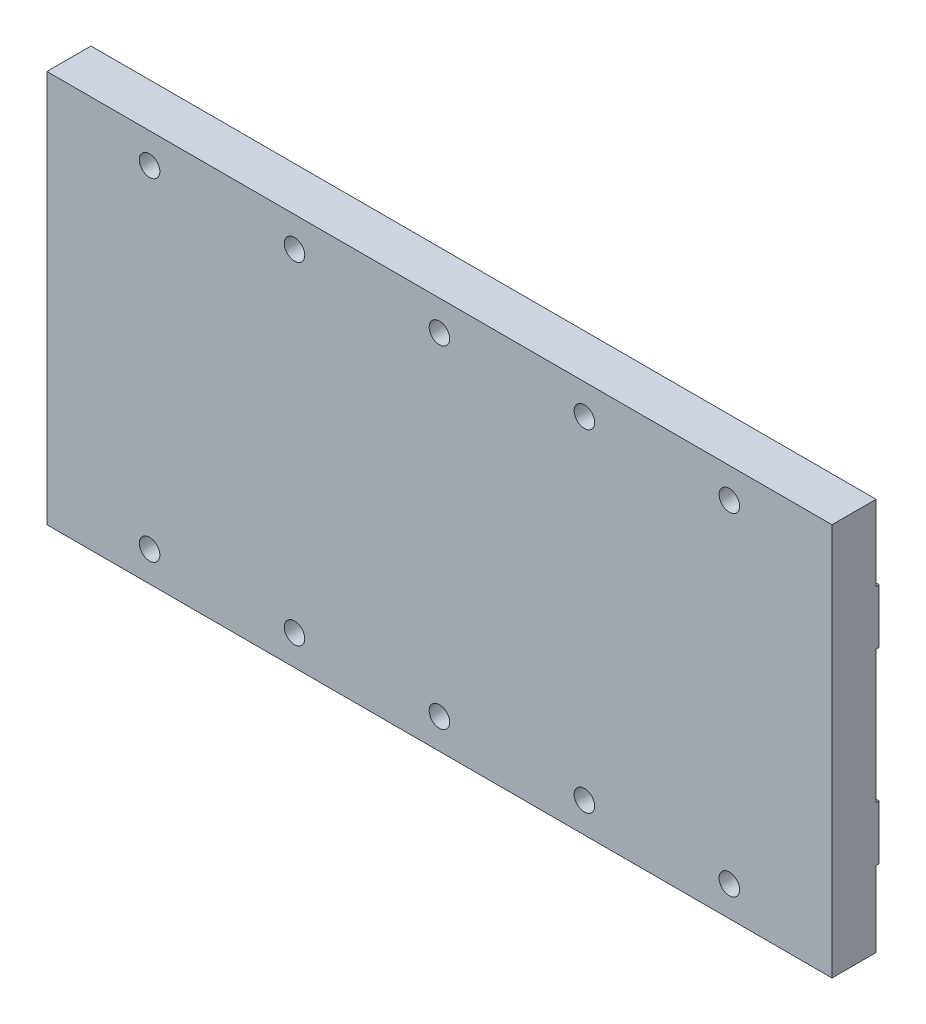
ISO-10303-21;
HEADER;
FILE_DESCRIPTION(('STEP AP214'),'2;1');
FILE_NAME('part.step','',(''),(''),'','','');
FILE_SCHEMA(('AUTOMOTIVE_DESIGN { 1 0 10303 214 1 1 1 1 }'));
ENDSEC;
DATA;
#1=APPLICATION_CONTEXT('core data for automotive mechanical design processes');
#2=APPLICATION_PROTOCOL_DEFINITION('international standard','automotive_design',2000,#1);
#3=PRODUCT_CONTEXT('',#1,'mechanical');
#4=PRODUCT('Part','Part','',(#3));
#5=PRODUCT_RELATED_PRODUCT_CATEGORY('part','',(#4));
#6=PRODUCT_DEFINITION_FORMATION('','',#4);
#7=PRODUCT_DEFINITION_CONTEXT('part definition',#1,'design');
#8=PRODUCT_DEFINITION('design','',#6,#7);
#9=PRODUCT_DEFINITION_SHAPE('','',#8);
#10=(LENGTH_UNIT() NAMED_UNIT(*) SI_UNIT(.MILLI.,.METRE.));
#11=(NAMED_UNIT(*) PLANE_ANGLE_UNIT() SI_UNIT($,.RADIAN.));
#12=(NAMED_UNIT(*) SI_UNIT($,.STERADIAN.) SOLID_ANGLE_UNIT());
#13=UNCERTAINTY_MEASURE_WITH_UNIT(LENGTH_MEASURE(1.E-05),#10,'distance_accuracy_value','');
#14=(GEOMETRIC_REPRESENTATION_CONTEXT(3) GLOBAL_UNCERTAINTY_ASSIGNED_CONTEXT((#13)) GLOBAL_UNIT_ASSIGNED_CONTEXT((#10,
#11,#12)) REPRESENTATION_CONTEXT('',''));
#15=CARTESIAN_POINT('',(0.,0.,0.));
#16=DIRECTION('',(0.,0.,1.));
#17=DIRECTION('',(1.,0.,0.));
#18=AXIS2_PLACEMENT_3D('',#15,#16,#17);
#19=CARTESIAN_POINT('',(0.,0.,7.8));
#20=DIRECTION('',(0.,0.,-1.));
#21=DIRECTION('',(-1.,0.,0.));
#22=AXIS2_PLACEMENT_3D('',#19,#20,#21);
#23=PLANE('',#22);
#24=CARTESIAN_POINT('',(17.,60.,7.8));
#25=DIRECTION('',(0.,0.,1.));
#26=DIRECTION('',(1.,0.,0.));
#27=AXIS2_PLACEMENT_3D('',#24,#25,#26);
#28=CIRCLE('',#27,1.69999999999999);
#29=CARTESIAN_POINT('',(18.7,60.,7.8));
#30=VERTEX_POINT('',#29);
#31=EDGE_CURVE('E835',#30,#30,#28,.T.);
#32=ORIENTED_EDGE('',*,*,#31,.F.);
#33=EDGE_LOOP('',(#32));
#34=FACE_BOUND('',#33,.T.);
#35=CARTESIAN_POINT('',(41.,60.,7.8));
#36=DIRECTION('',(0.,0.,1.));
#37=DIRECTION('',(1.,0.,0.));
#38=AXIS2_PLACEMENT_3D('',#35,#36,#37);
#39=CIRCLE('',#38,1.69999999999999);
#40=CARTESIAN_POINT('',(42.7,60.,7.8));
#41=VERTEX_POINT('',#40);
#42=EDGE_CURVE('E349',#41,#41,#39,.T.);
#43=ORIENTED_EDGE('',*,*,#42,.F.);
#44=EDGE_LOOP('',(#43));
#45=FACE_BOUND('',#44,.T.);
#46=CARTESIAN_POINT('',(65.,60.,7.8));
#47=DIRECTION('',(0.,0.,1.));
#48=DIRECTION('',(1.,0.,0.));
#49=AXIS2_PLACEMENT_3D('',#46,#47,#48);
#50=CIRCLE('',#49,1.69999999999999);
#51=CARTESIAN_POINT('',(66.7,60.,7.8));
#52=VERTEX_POINT('',#51);
#53=EDGE_CURVE('E340',#52,#52,#50,.T.);
#54=ORIENTED_EDGE('',*,*,#53,.F.);
#55=EDGE_LOOP('',(#54));
#56=FACE_BOUND('',#55,.T.);
#57=CARTESIAN_POINT('',(89.,60.,7.8));
#58=DIRECTION('',(0.,0.,1.));
#59=DIRECTION('',(1.,0.,0.));
#60=AXIS2_PLACEMENT_3D('',#57,#58,#59);
#61=CIRCLE('',#60,1.69999999999999);
#62=CARTESIAN_POINT('',(90.7,60.,7.8));
#63=VERTEX_POINT('',#62);
#64=EDGE_CURVE('E335',#63,#63,#61,.T.);
#65=ORIENTED_EDGE('',*,*,#64,.F.);
#66=EDGE_LOOP('',(#65));
#67=FACE_BOUND('',#66,.T.);
#68=CARTESIAN_POINT('',(113.,60.,7.8));
#69=DIRECTION('',(0.,0.,1.));
#70=DIRECTION('',(1.,0.,0.));
#71=AXIS2_PLACEMENT_3D('',#68,#69,#70);
#72=CIRCLE('',#71,1.69999999999999);
#73=CARTESIAN_POINT('',(114.7,60.,7.8));
#74=VERTEX_POINT('',#73);
#75=EDGE_CURVE('E330',#74,#74,#72,.T.);
#76=ORIENTED_EDGE('',*,*,#75,.F.);
#77=EDGE_LOOP('',(#76));
#78=FACE_BOUND('',#77,.T.);
#79=CARTESIAN_POINT('',(113.,5.,7.8));
#80=DIRECTION('',(0.,0.,1.));
#81=DIRECTION('',(1.,0.,0.));
#82=AXIS2_PLACEMENT_3D('',#79,#80,#81);
#83=CIRCLE('',#82,1.69999999999999);
#84=CARTESIAN_POINT('',(114.7,5.,7.8));
#85=VERTEX_POINT('',#84);
#86=EDGE_CURVE('E324',#85,#85,#83,.T.);
#87=ORIENTED_EDGE('',*,*,#86,.F.);
#88=EDGE_LOOP('',(#87));
#89=FACE_BOUND('',#88,.T.);
#90=CARTESIAN_POINT('',(89.,5.,7.8));
#91=DIRECTION('',(0.,0.,1.));
#92=DIRECTION('',(1.,0.,0.));
#93=AXIS2_PLACEMENT_3D('',#90,#91,#92);
#94=CIRCLE('',#93,1.69999999999999);
#95=CARTESIAN_POINT('',(90.7,5.,7.8));
#96=VERTEX_POINT('',#95);
#97=EDGE_CURVE('E318',#96,#96,#94,.T.);
#98=ORIENTED_EDGE('',*,*,#97,.F.);
#99=EDGE_LOOP('',(#98));
#100=FACE_BOUND('',#99,.T.);
#101=CARTESIAN_POINT('',(65.,5.,7.8));
#102=DIRECTION('',(0.,0.,1.));
#103=DIRECTION('',(1.,0.,0.));
#104=AXIS2_PLACEMENT_3D('',#101,#102,#103);
#105=CIRCLE('',#104,1.69999999999999);
#106=CARTESIAN_POINT('',(66.7,5.,7.8));
#107=VERTEX_POINT('',#106);
#108=EDGE_CURVE('E312',#107,#107,#105,.T.);
#109=ORIENTED_EDGE('',*,*,#108,.F.);
#110=EDGE_LOOP('',(#109));
#111=FACE_BOUND('',#110,.T.);
#112=CARTESIAN_POINT('',(41.,5.,7.8));
#113=DIRECTION('',(0.,0.,1.));
#114=DIRECTION('',(1.,0.,0.));
#115=AXIS2_PLACEMENT_3D('',#112,#113,#114);
#116=CIRCLE('',#115,1.69999999999999);
#117=CARTESIAN_POINT('',(42.7,5.,7.8));
#118=VERTEX_POINT('',#117);
#119=EDGE_CURVE('E306',#118,#118,#116,.T.);
#120=ORIENTED_EDGE('',*,*,#119,.F.);
#121=EDGE_LOOP('',(#120));
#122=FACE_BOUND('',#121,.T.);
#123=DIRECTION('',(0.,-1.,0.));
#124=VECTOR('',#123,1.);
#125=CARTESIAN_POINT('',(0.,0.,7.8));
#126=LINE('',#125,#124);
#127=CARTESIAN_POINT('',(0.,65.,7.8));
#128=VERTEX_POINT('',#127);
#129=CARTESIAN_POINT('',(0.,0.,7.8));
#130=VERTEX_POINT('',#129);
#131=EDGE_CURVE('E256',#128,#130,#126,.T.);
#132=ORIENTED_EDGE('',*,*,#131,.T.);
#133=DIRECTION('',(1.,0.,0.));
#134=VECTOR('',#133,1.);
#135=CARTESIAN_POINT('',(0.,0.,7.8));
#136=LINE('',#135,#134);
#137=CARTESIAN_POINT('',(130.,0.,7.8));
#138=VERTEX_POINT('',#137);
#139=EDGE_CURVE('E260',#130,#138,#136,.T.);
#140=ORIENTED_EDGE('',*,*,#139,.T.);
#141=DIRECTION('',(0.,1.,0.));
#142=VECTOR('',#141,1.);
#143=CARTESIAN_POINT('',(130.,0.,7.8));
#144=LINE('',#143,#142);
#145=CARTESIAN_POINT('',(130.,65.,7.8));
#146=VERTEX_POINT('',#145);
#147=EDGE_CURVE('E264',#138,#146,#144,.T.);
#148=ORIENTED_EDGE('',*,*,#147,.T.);
#149=DIRECTION('',(-1.,0.,0.));
#150=VECTOR('',#149,1.);
#151=CARTESIAN_POINT('',(0.,65.,7.8));
#152=LINE('',#151,#150);
#153=EDGE_CURVE('E267',#146,#128,#152,.T.);
#154=ORIENTED_EDGE('',*,*,#153,.T.);
#155=EDGE_LOOP('',(#132,#140,#148,#154));
#156=FACE_BOUND('',#155,.T.);
#157=CARTESIAN_POINT('',(17.,5.,7.8));
#158=DIRECTION('',(0.,0.,1.));
#159=DIRECTION('',(1.,0.,0.));
#160=AXIS2_PLACEMENT_3D('',#157,#158,#159);
#161=CIRCLE('',#160,1.69999999999999);
#162=CARTESIAN_POINT('',(18.7,5.,7.8));
#163=VERTEX_POINT('',#162);
#164=EDGE_CURVE('E300',#163,#163,#161,.T.);
#165=ORIENTED_EDGE('',*,*,#164,.F.);
#166=EDGE_LOOP('',(#165));
#167=FACE_BOUND('',#166,.T.);
#168=ADVANCED_FACE('F39',(#34,#45,#56,#67,#78,#89,#100,#111,#122,#156,#167),#23,.F.);
#169=CARTESIAN_POINT('',(0.,0.,0.));
#170=DIRECTION('',(0.,0.,-1.));
#171=DIRECTION('',(-1.,0.,0.));
#172=AXIS2_PLACEMENT_3D('',#169,#170,#171);
#173=PLANE('',#172);
#174=DIRECTION('',(-1.,0.,0.));
#175=VECTOR('',#174,1.);
#176=CARTESIAN_POINT('',(130.,52.5,0.));
#177=LINE('',#176,#175);
#178=CARTESIAN_POINT('',(130.,52.5,0.));
#179=VERTEX_POINT('',#178);
#180=CARTESIAN_POINT('',(0.,52.5,0.));
#181=VERTEX_POINT('',#180);
#182=EDGE_CURVE('E153',#179,#181,#177,.T.);
#183=ORIENTED_EDGE('',*,*,#182,.F.);
#184=DIRECTION('',(0.,1.,0.));
#185=VECTOR('',#184,1.);
#186=CARTESIAN_POINT('',(130.,0.,0.));
#187=LINE('',#186,#185);
#188=CARTESIAN_POINT('',(130.,43.5,0.));
#189=VERTEX_POINT('',#188);
#190=EDGE_CURVE('E159',#189,#179,#187,.T.);
#191=ORIENTED_EDGE('',*,*,#190,.F.);
#192=DIRECTION('',(1.,0.,0.));
#193=VECTOR('',#192,1.);
#194=CARTESIAN_POINT('',(130.,43.5,0.));
#195=LINE('',#194,#193);
#196=CARTESIAN_POINT('',(0.,43.5,0.));
#197=VERTEX_POINT('',#196);
#198=EDGE_CURVE('E195',#197,#189,#195,.T.);
#199=ORIENTED_EDGE('',*,*,#198,.F.);
#200=DIRECTION('',(0.,-1.,0.));
#201=VECTOR('',#200,1.);
#202=CARTESIAN_POINT('',(0.,0.,0.));
#203=LINE('',#202,#201);
#204=EDGE_CURVE('E274',#181,#197,#203,.T.);
#205=ORIENTED_EDGE('',*,*,#204,.F.);
#206=EDGE_LOOP('',(#183,#191,#199,#205));
#207=FACE_BOUND('',#206,.T.);
#208=ADVANCED_FACE('F411',(#207),#173,.T.);
#209=CARTESIAN_POINT('',(0.,0.,7.8));
#210=DIRECTION('',(0.,1.,0.));
#211=DIRECTION('',(0.,0.,1.));
#212=AXIS2_PLACEMENT_3D('',#209,#210,#211);
#213=PLANE('',#212);
#214=DIRECTION('',(-1.,0.,0.));
#215=VECTOR('',#214,1.);
#216=CARTESIAN_POINT('',(0.,0.,0.5));
#217=LINE('',#216,#215);
#218=CARTESIAN_POINT('',(130.,0.,0.5));
#219=VERTEX_POINT('',#218);
#220=CARTESIAN_POINT('',(0.,0.,0.5));
#221=VERTEX_POINT('',#220);
#222=EDGE_CURVE('E178',#219,#221,#217,.T.);
#223=ORIENTED_EDGE('',*,*,#222,.F.);
#224=DIRECTION('',(0.,0.,-1.));
#225=VECTOR('',#224,1.);
#226=CARTESIAN_POINT('',(130.,0.,7.8));
#227=LINE('',#226,#225);
#228=EDGE_CURVE('E49',#138,#219,#227,.T.);
#229=ORIENTED_EDGE('',*,*,#228,.F.);
#230=ORIENTED_EDGE('',*,*,#139,.F.);
#231=DIRECTION('',(0.,0.,-1.));
#232=VECTOR('',#231,1.);
#233=CARTESIAN_POINT('',(0.,0.,7.8));
#234=LINE('',#233,#232);
#235=EDGE_CURVE('E11',#130,#221,#234,.T.);
#236=ORIENTED_EDGE('',*,*,#235,.T.);
#237=EDGE_LOOP('',(#223,#229,#230,#236));
#238=FACE_BOUND('',#237,.T.);
#239=ADVANCED_FACE('F449',(#238),#213,.F.);
#240=CARTESIAN_POINT('',(0.,65.,7.8));
#241=DIRECTION('',(0.,-1.,0.));
#242=DIRECTION('',(0.,0.,-1.));
#243=AXIS2_PLACEMENT_3D('',#240,#241,#242);
#244=PLANE('',#243);
#245=DIRECTION('',(1.,0.,0.));
#246=VECTOR('',#245,1.);
#247=CARTESIAN_POINT('',(130.,65.,0.5));
#248=LINE('',#247,#246);
#249=CARTESIAN_POINT('',(0.,65.,0.5));
#250=VERTEX_POINT('',#249);
#251=CARTESIAN_POINT('',(130.,65.,0.5));
#252=VERTEX_POINT('',#251);
#253=EDGE_CURVE('E148',#250,#252,#248,.T.);
#254=ORIENTED_EDGE('',*,*,#253,.F.);
#255=DIRECTION('',(0.,0.,-1.));
#256=VECTOR('',#255,1.);
#257=CARTESIAN_POINT('',(0.,65.,7.8));
#258=LINE('',#257,#256);
#259=EDGE_CURVE('E270',#128,#250,#258,.T.);
#260=ORIENTED_EDGE('',*,*,#259,.F.);
#261=ORIENTED_EDGE('',*,*,#153,.F.);
#262=DIRECTION('',(0.,0.,-1.));
#263=VECTOR('',#262,1.);
#264=CARTESIAN_POINT('',(130.,65.,7.8));
#265=LINE('',#264,#263);
#266=EDGE_CURVE('E280',#146,#252,#265,.T.);
#267=ORIENTED_EDGE('',*,*,#266,.T.);
#268=EDGE_LOOP('',(#254,#260,#261,#267));
#269=FACE_BOUND('',#268,.T.);
#270=ADVANCED_FACE('F459',(#269),#244,.F.);
#271=CARTESIAN_POINT('',(113.,5.,7.8));
#272=DIRECTION('',(0.,0.,-1.));
#273=DIRECTION('',(-1.,0.,0.));
#274=AXIS2_PLACEMENT_3D('',#271,#272,#273);
#275=CYLINDRICAL_SURFACE('',#274,1.29999999999999);
#276=CARTESIAN_POINT('',(113.,5.,0.581118804735831));
#277=DIRECTION('',(0.,0.,1.));
#278=DIRECTION('',(1.,0.,0.));
#279=AXIS2_PLACEMENT_3D('',#276,#277,#278);
#280=CIRCLE('',#279,1.29999999999999);
#281=CARTESIAN_POINT('',(114.3,5.,0.581118804735831));
#282=VERTEX_POINT('',#281);
#283=EDGE_CURVE('E314',#282,#282,#280,.F.);
#284=ORIENTED_EDGE('',*,*,#283,.F.);
#285=EDGE_LOOP('',(#284));
#286=FACE_BOUND('',#285,.T.);
#287=CARTESIAN_POINT('',(113.,5.,0.5));
#288=DIRECTION('',(0.,0.,-1.));
#289=DIRECTION('',(-1.,0.,0.));
#290=AXIS2_PLACEMENT_3D('',#287,#288,#289);
#291=CIRCLE('',#290,1.29999999999999);
#292=CARTESIAN_POINT('',(111.7,5.,0.5));
#293=VERTEX_POINT('',#292);
#294=EDGE_CURVE('E251',#293,#293,#291,.T.);
#295=ORIENTED_EDGE('',*,*,#294,.T.);
#296=EDGE_LOOP('',(#295));
#297=FACE_BOUND('',#296,.T.);
#298=ADVANCED_FACE('F454',(#286,#297),#275,.F.);
#299=CARTESIAN_POINT('',(89.,5.,7.8));
#300=DIRECTION('',(0.,0.,-1.));
#301=DIRECTION('',(-1.,0.,0.));
#302=AXIS2_PLACEMENT_3D('',#299,#300,#301);
#303=CYLINDRICAL_SURFACE('',#302,1.29999999999999);
#304=CARTESIAN_POINT('',(89.,5.,0.581118804735831));
#305=DIRECTION('',(0.,0.,1.));
#306=DIRECTION('',(1.,0.,0.));
#307=AXIS2_PLACEMENT_3D('',#304,#305,#306);
#308=CIRCLE('',#307,1.29999999999999);
#309=CARTESIAN_POINT('',(90.3,5.,0.581118804735831));
#310=VERTEX_POINT('',#309);
#311=EDGE_CURVE('E308',#310,#310,#308,.F.);
#312=ORIENTED_EDGE('',*,*,#311,.F.);
#313=EDGE_LOOP('',(#312));
#314=FACE_BOUND('',#313,.T.);
#315=CARTESIAN_POINT('',(89.,5.,0.5));
#316=DIRECTION('',(0.,0.,-1.));
#317=DIRECTION('',(-1.,0.,0.));
#318=AXIS2_PLACEMENT_3D('',#315,#316,#317);
#319=CIRCLE('',#318,1.29999999999999);
#320=CARTESIAN_POINT('',(87.7,5.,0.5));
#321=VERTEX_POINT('',#320);
#322=EDGE_CURVE('E247',#321,#321,#319,.T.);
#323=ORIENTED_EDGE('',*,*,#322,.T.);
#324=EDGE_LOOP('',(#323));
#325=FACE_BOUND('',#324,.T.);
#326=ADVANCED_FACE('F551',(#314,#325),#303,.F.);
#327=CARTESIAN_POINT('',(65.,5.,7.8));
#328=DIRECTION('',(0.,0.,-1.));
#329=DIRECTION('',(-1.,0.,0.));
#330=AXIS2_PLACEMENT_3D('',#327,#328,#329);
#331=CYLINDRICAL_SURFACE('',#330,1.29999999999999);
#332=CARTESIAN_POINT('',(65.,5.,0.581118804735831));
#333=DIRECTION('',(0.,0.,1.));
#334=DIRECTION('',(1.,0.,0.));
#335=AXIS2_PLACEMENT_3D('',#332,#333,#334);
#336=CIRCLE('',#335,1.29999999999999);
#337=CARTESIAN_POINT('',(66.3,5.,0.581118804735831));
#338=VERTEX_POINT('',#337);
#339=EDGE_CURVE('E302',#338,#338,#336,.F.);
#340=ORIENTED_EDGE('',*,*,#339,.F.);
#341=EDGE_LOOP('',(#340));
#342=FACE_BOUND('',#341,.T.);
#343=CARTESIAN_POINT('',(65.,5.,0.5));
#344=DIRECTION('',(0.,0.,-1.));
#345=DIRECTION('',(-1.,0.,0.));
#346=AXIS2_PLACEMENT_3D('',#343,#344,#345);
#347=CIRCLE('',#346,1.29999999999999);
#348=CARTESIAN_POINT('',(63.7,5.,0.5));
#349=VERTEX_POINT('',#348);
#350=EDGE_CURVE('E243',#349,#349,#347,.T.);
#351=ORIENTED_EDGE('',*,*,#350,.T.);
#352=EDGE_LOOP('',(#351));
#353=FACE_BOUND('',#352,.T.);
#354=ADVANCED_FACE('F561',(#342,#353),#331,.F.);
#355=CARTESIAN_POINT('',(41.,5.,7.8));
#356=DIRECTION('',(0.,0.,-1.));
#357=DIRECTION('',(-1.,0.,0.));
#358=AXIS2_PLACEMENT_3D('',#355,#356,#357);
#359=CYLINDRICAL_SURFACE('',#358,1.3);
#360=CARTESIAN_POINT('',(41.,5.,0.581118804735832));
#361=DIRECTION('',(0.,0.,1.));
#362=DIRECTION('',(1.,0.,0.));
#363=AXIS2_PLACEMENT_3D('',#360,#361,#362);
#364=CIRCLE('',#363,1.3);
#365=CARTESIAN_POINT('',(42.3,5.,0.581118804735832));
#366=VERTEX_POINT('',#365);
#367=EDGE_CURVE('E296',#366,#366,#364,.F.);
#368=ORIENTED_EDGE('',*,*,#367,.F.);
#369=EDGE_LOOP('',(#368));
#370=FACE_BOUND('',#369,.T.);
#371=CARTESIAN_POINT('',(41.,5.,0.5));
#372=DIRECTION('',(0.,0.,-1.));
#373=DIRECTION('',(-1.,0.,0.));
#374=AXIS2_PLACEMENT_3D('',#371,#372,#373);
#375=CIRCLE('',#374,1.3);
#376=CARTESIAN_POINT('',(39.7,5.,0.5));
#377=VERTEX_POINT('',#376);
#378=EDGE_CURVE('E239',#377,#377,#375,.T.);
#379=ORIENTED_EDGE('',*,*,#378,.T.);
#380=EDGE_LOOP('',(#379));
#381=FACE_BOUND('',#380,.T.);
#382=ADVANCED_FACE('F570',(#370,#381),#359,.F.);
#383=CARTESIAN_POINT('',(17.,5.,7.8));
#384=DIRECTION('',(0.,0.,-1.));
#385=DIRECTION('',(-1.,0.,0.));
#386=AXIS2_PLACEMENT_3D('',#383,#384,#385);
#387=CYLINDRICAL_SURFACE('',#386,1.3);
#388=CARTESIAN_POINT('',(17.,5.,0.581118804735831));
#389=DIRECTION('',(0.,0.,1.));
#390=DIRECTION('',(1.,0.,0.));
#391=AXIS2_PLACEMENT_3D('',#388,#389,#390);
#392=CIRCLE('',#391,1.3);
#393=CARTESIAN_POINT('',(18.3,5.,0.581118804735831));
#394=VERTEX_POINT('',#393);
#395=EDGE_CURVE('E208',#394,#394,#392,.F.);
#396=ORIENTED_EDGE('',*,*,#395,.F.);
#397=EDGE_LOOP('',(#396));
#398=FACE_BOUND('',#397,.T.);
#399=CARTESIAN_POINT('',(17.,5.,0.5));
#400=DIRECTION('',(0.,0.,-1.));
#401=DIRECTION('',(-1.,0.,0.));
#402=AXIS2_PLACEMENT_3D('',#399,#400,#401);
#403=CIRCLE('',#402,1.3);
#404=CARTESIAN_POINT('',(15.7,5.,0.5));
#405=VERTEX_POINT('',#404);
#406=EDGE_CURVE('E238',#405,#405,#403,.T.);
#407=ORIENTED_EDGE('',*,*,#406,.T.);
#408=EDGE_LOOP('',(#407));
#409=FACE_BOUND('',#408,.T.);
#410=ADVANCED_FACE('F580',(#398,#409),#387,.F.);
#411=CARTESIAN_POINT('',(113.,60.,7.8));
#412=DIRECTION('',(0.,0.,-1.));
#413=DIRECTION('',(-1.,0.,0.));
#414=AXIS2_PLACEMENT_3D('',#411,#412,#413);
#415=CYLINDRICAL_SURFACE('',#414,1.29999999999999);
#416=CARTESIAN_POINT('',(113.,60.,0.58111880473583));
#417=DIRECTION('',(0.,0.,1.));
#418=DIRECTION('',(1.,0.,0.));
#419=AXIS2_PLACEMENT_3D('',#416,#417,#418);
#420=CIRCLE('',#419,1.29999999999999);
#421=CARTESIAN_POINT('',(114.3,60.,0.58111880473583));
#422=VERTEX_POINT('',#421);
#423=EDGE_CURVE('E320',#422,#422,#420,.F.);
#424=ORIENTED_EDGE('',*,*,#423,.F.);
#425=EDGE_LOOP('',(#424));
#426=FACE_BOUND('',#425,.T.);
#427=CARTESIAN_POINT('',(113.,60.,0.5));
#428=DIRECTION('',(0.,0.,-1.));
#429=DIRECTION('',(-1.,0.,0.));
#430=AXIS2_PLACEMENT_3D('',#427,#428,#429);
#431=CIRCLE('',#430,1.29999999999999);
#432=CARTESIAN_POINT('',(111.7,60.,0.5));
#433=VERTEX_POINT('',#432);
#434=EDGE_CURVE('E234',#433,#433,#431,.T.);
#435=ORIENTED_EDGE('',*,*,#434,.T.);
#436=EDGE_LOOP('',(#435));
#437=FACE_BOUND('',#436,.T.);
#438=ADVANCED_FACE('F590',(#426,#437),#415,.F.);
#439=CARTESIAN_POINT('',(89.,60.,7.8));
#440=DIRECTION('',(0.,0.,-1.));
#441=DIRECTION('',(-1.,0.,0.));
#442=AXIS2_PLACEMENT_3D('',#439,#440,#441);
#443=CYLINDRICAL_SURFACE('',#442,1.29999999999999);
#444=CARTESIAN_POINT('',(89.,60.,0.58111880473583));
#445=DIRECTION('',(0.,0.,1.));
#446=DIRECTION('',(1.,0.,0.));
#447=AXIS2_PLACEMENT_3D('',#444,#445,#446);
#448=CIRCLE('',#447,1.29999999999999);
#449=CARTESIAN_POINT('',(90.3,60.,0.58111880473583));
#450=VERTEX_POINT('',#449);
#451=EDGE_CURVE('E326',#450,#450,#448,.F.);
#452=ORIENTED_EDGE('',*,*,#451,.F.);
#453=EDGE_LOOP('',(#452));
#454=FACE_BOUND('',#453,.T.);
#455=CARTESIAN_POINT('',(89.,60.,0.5));
#456=DIRECTION('',(0.,0.,-1.));
#457=DIRECTION('',(-1.,0.,0.));
#458=AXIS2_PLACEMENT_3D('',#455,#456,#457);
#459=CIRCLE('',#458,1.29999999999999);
#460=CARTESIAN_POINT('',(87.7,60.,0.5));
#461=VERTEX_POINT('',#460);
#462=EDGE_CURVE('E230',#461,#461,#459,.T.);
#463=ORIENTED_EDGE('',*,*,#462,.T.);
#464=EDGE_LOOP('',(#463));
#465=FACE_BOUND('',#464,.T.);
#466=ADVANCED_FACE('F600',(#454,#465),#443,.F.);
#467=CARTESIAN_POINT('',(65.,60.,7.8));
#468=DIRECTION('',(0.,0.,-1.));
#469=DIRECTION('',(-1.,0.,0.));
#470=AXIS2_PLACEMENT_3D('',#467,#468,#469);
#471=CYLINDRICAL_SURFACE('',#470,1.29999999999999);
#472=CARTESIAN_POINT('',(65.,60.,0.58111880473583));
#473=DIRECTION('',(0.,0.,1.));
#474=DIRECTION('',(1.,0.,0.));
#475=AXIS2_PLACEMENT_3D('',#472,#473,#474);
#476=CIRCLE('',#475,1.29999999999999);
#477=CARTESIAN_POINT('',(66.3,60.,0.58111880473583));
#478=VERTEX_POINT('',#477);
#479=EDGE_CURVE('E332',#478,#478,#476,.F.);
#480=ORIENTED_EDGE('',*,*,#479,.F.);
#481=EDGE_LOOP('',(#480));
#482=FACE_BOUND('',#481,.T.);
#483=CARTESIAN_POINT('',(65.,60.,0.5));
#484=DIRECTION('',(0.,0.,-1.));
#485=DIRECTION('',(-1.,0.,0.));
#486=AXIS2_PLACEMENT_3D('',#483,#484,#485);
#487=CIRCLE('',#486,1.29999999999999);
#488=CARTESIAN_POINT('',(63.7,60.,0.5));
#489=VERTEX_POINT('',#488);
#490=EDGE_CURVE('E226',#489,#489,#487,.T.);
#491=ORIENTED_EDGE('',*,*,#490,.T.);
#492=EDGE_LOOP('',(#491));
#493=FACE_BOUND('',#492,.T.);
#494=ADVANCED_FACE('F610',(#482,#493),#471,.F.);
#495=CARTESIAN_POINT('',(41.,60.,7.8));
#496=DIRECTION('',(0.,0.,-1.));
#497=DIRECTION('',(-1.,0.,0.));
#498=AXIS2_PLACEMENT_3D('',#495,#496,#497);
#499=CYLINDRICAL_SURFACE('',#498,1.3);
#500=CARTESIAN_POINT('',(41.,60.,0.581118804735832));
#501=DIRECTION('',(0.,0.,1.));
#502=DIRECTION('',(1.,0.,0.));
#503=AXIS2_PLACEMENT_3D('',#500,#501,#502);
#504=CIRCLE('',#503,1.3);
#505=CARTESIAN_POINT('',(42.3,60.,0.581118804735832));
#506=VERTEX_POINT('',#505);
#507=EDGE_CURVE('E337',#506,#506,#504,.F.);
#508=ORIENTED_EDGE('',*,*,#507,.F.);
#509=EDGE_LOOP('',(#508));
#510=FACE_BOUND('',#509,.T.);
#511=CARTESIAN_POINT('',(41.,60.,0.5));
#512=DIRECTION('',(0.,0.,-1.));
#513=DIRECTION('',(-1.,0.,0.));
#514=AXIS2_PLACEMENT_3D('',#511,#512,#513);
#515=CIRCLE('',#514,1.3);
#516=CARTESIAN_POINT('',(39.7,60.,0.5));
#517=VERTEX_POINT('',#516);
#518=EDGE_CURVE('E222',#517,#517,#515,.T.);
#519=ORIENTED_EDGE('',*,*,#518,.T.);
#520=EDGE_LOOP('',(#519));
#521=FACE_BOUND('',#520,.T.);
#522=ADVANCED_FACE('F620',(#510,#521),#499,.F.);
#523=CARTESIAN_POINT('',(17.,60.,7.8));
#524=DIRECTION('',(0.,0.,-1.));
#525=DIRECTION('',(-1.,0.,0.));
#526=AXIS2_PLACEMENT_3D('',#523,#524,#525);
#527=CYLINDRICAL_SURFACE('',#526,1.3);
#528=CARTESIAN_POINT('',(17.,60.,0.581118804735831));
#529=DIRECTION('',(0.,0.,1.));
#530=DIRECTION('',(1.,0.,0.));
#531=AXIS2_PLACEMENT_3D('',#528,#529,#530);
#532=CIRCLE('',#531,1.3);
#533=CARTESIAN_POINT('',(18.3,60.,0.581118804735831));
#534=VERTEX_POINT('',#533);
#535=EDGE_CURVE('E43',#534,#534,#532,.F.);
#536=ORIENTED_EDGE('',*,*,#535,.F.);
#537=EDGE_LOOP('',(#536));
#538=FACE_BOUND('',#537,.T.);
#539=CARTESIAN_POINT('',(17.,60.,0.5));
#540=DIRECTION('',(0.,0.,-1.));
#541=DIRECTION('',(-1.,0.,0.));
#542=AXIS2_PLACEMENT_3D('',#539,#540,#541);
#543=CIRCLE('',#542,1.3);
#544=CARTESIAN_POINT('',(15.7,60.,0.5));
#545=VERTEX_POINT('',#544);
#546=EDGE_CURVE('E164',#545,#545,#543,.T.);
#547=ORIENTED_EDGE('',*,*,#546,.T.);
#548=EDGE_LOOP('',(#547));
#549=FACE_BOUND('',#548,.T.);
#550=ADVANCED_FACE('F458',(#538,#549),#527,.F.);
#551=DIRECTION('',(1.,0.,0.));
#552=VECTOR('',#551,1.);
#553=CARTESIAN_POINT('',(0.,12.5,0.));
#554=LINE('',#553,#552);
#555=CARTESIAN_POINT('',(0.,12.5,0.));
#556=VERTEX_POINT('',#555);
#557=CARTESIAN_POINT('',(130.,12.5,0.));
#558=VERTEX_POINT('',#557);
#559=EDGE_CURVE('E172',#556,#558,#554,.T.);
#560=ORIENTED_EDGE('',*,*,#559,.F.);
#561=CARTESIAN_POINT('',(0.,21.5,0.));
#562=VERTEX_POINT('',#561);
#563=EDGE_CURVE('E255',#562,#556,#203,.T.);
#564=ORIENTED_EDGE('',*,*,#563,.F.);
#565=DIRECTION('',(-1.,0.,0.));
#566=VECTOR('',#565,1.);
#567=CARTESIAN_POINT('',(130.,21.5,0.));
#568=LINE('',#567,#566);
#569=CARTESIAN_POINT('',(130.,21.5,0.));
#570=VERTEX_POINT('',#569);
#571=EDGE_CURVE('E205',#570,#562,#568,.T.);
#572=ORIENTED_EDGE('',*,*,#571,.F.);
#573=EDGE_CURVE('E261',#558,#570,#187,.T.);
#574=ORIENTED_EDGE('',*,*,#573,.F.);
#575=EDGE_LOOP('',(#560,#564,#572,#574));
#576=FACE_BOUND('',#575,.T.);
#577=ADVANCED_FACE('F422',(#576),#173,.T.);
#578=CARTESIAN_POINT('',(0.,0.,7.8));
#579=DIRECTION('',(1.,0.,0.));
#580=DIRECTION('',(0.,0.,-1.));
#581=AXIS2_PLACEMENT_3D('',#578,#579,#580);
#582=PLANE('',#581);
#583=DIRECTION('',(0.,1.,0.));
#584=VECTOR('',#583,1.);
#585=CARTESIAN_POINT('',(0.,65.,0.5));
#586=LINE('',#585,#584);
#587=CARTESIAN_POINT('',(0.,52.5,0.5));
#588=VERTEX_POINT('',#587);
#589=EDGE_CURVE('E142',#588,#250,#586,.T.);
#590=ORIENTED_EDGE('',*,*,#589,.F.);
#591=DIRECTION('',(0.,0.,-1.));
#592=VECTOR('',#591,1.);
#593=CARTESIAN_POINT('',(0.,52.5,0.5));
#594=LINE('',#593,#592);
#595=EDGE_CURVE('E138',#588,#181,#594,.T.);
#596=ORIENTED_EDGE('',*,*,#595,.T.);
#597=ORIENTED_EDGE('',*,*,#204,.T.);
#598=DIRECTION('',(0.,0.,-1.));
#599=VECTOR('',#598,1.);
#600=CARTESIAN_POINT('',(0.,43.5,0.5));
#601=LINE('',#600,#599);
#602=CARTESIAN_POINT('',(0.,43.5,0.5));
#603=VERTEX_POINT('',#602);
#604=EDGE_CURVE('E213',#603,#197,#601,.T.);
#605=ORIENTED_EDGE('',*,*,#604,.F.);
#606=DIRECTION('',(0.,1.,0.));
#607=VECTOR('',#606,1.);
#608=CARTESIAN_POINT('',(0.,43.5,0.5));
#609=LINE('',#608,#607);
#610=CARTESIAN_POINT('',(0.,21.5,0.5));
#611=VERTEX_POINT('',#610);
#612=EDGE_CURVE('E199',#611,#603,#609,.T.);
#613=ORIENTED_EDGE('',*,*,#612,.F.);
#614=DIRECTION('',(0.,0.,-1.));
#615=VECTOR('',#614,1.);
#616=CARTESIAN_POINT('',(0.,21.5,0.5));
#617=LINE('',#616,#615);
#618=EDGE_CURVE('E216',#611,#562,#617,.T.);
#619=ORIENTED_EDGE('',*,*,#618,.T.);
#620=ORIENTED_EDGE('',*,*,#563,.T.);
#621=DIRECTION('',(0.,0.,-1.));
#622=VECTOR('',#621,1.);
#623=CARTESIAN_POINT('',(0.,12.5,0.5));
#624=LINE('',#623,#622);
#625=CARTESIAN_POINT('',(0.,12.5,0.5));
#626=VERTEX_POINT('',#625);
#627=EDGE_CURVE('E181',#626,#556,#624,.T.);
#628=ORIENTED_EDGE('',*,*,#627,.F.);
#629=DIRECTION('',(0.,1.,0.));
#630=VECTOR('',#629,1.);
#631=CARTESIAN_POINT('',(0.,0.,0.5));
#632=LINE('',#631,#630);
#633=EDGE_CURVE('E169',#221,#626,#632,.T.);
#634=ORIENTED_EDGE('',*,*,#633,.F.);
#635=ORIENTED_EDGE('',*,*,#235,.F.);
#636=ORIENTED_EDGE('',*,*,#131,.F.);
#637=ORIENTED_EDGE('',*,*,#259,.T.);
#638=EDGE_LOOP('',(#590,#596,#597,#605,#613,#619,#620,#628,#634,#635,#636,#637));
#639=FACE_BOUND('',#638,.T.);
#640=ADVANCED_FACE('F41',(#639),#582,.F.);
#641=CARTESIAN_POINT('',(130.,0.,7.8));
#642=DIRECTION('',(-1.,0.,0.));
#643=DIRECTION('',(0.,0.,1.));
#644=AXIS2_PLACEMENT_3D('',#641,#642,#643);
#645=PLANE('',#644);
#646=ORIENTED_EDGE('',*,*,#190,.T.);
#647=DIRECTION('',(0.,0.,-1.));
#648=VECTOR('',#647,1.);
#649=CARTESIAN_POINT('',(130.,52.5,0.5));
#650=LINE('',#649,#648);
#651=CARTESIAN_POINT('',(130.,52.5,0.5));
#652=VERTEX_POINT('',#651);
#653=EDGE_CURVE('E135',#652,#179,#650,.T.);
#654=ORIENTED_EDGE('',*,*,#653,.F.);
#655=DIRECTION('',(0.,-1.,0.));
#656=VECTOR('',#655,1.);
#657=CARTESIAN_POINT('',(130.,65.,0.5));
#658=LINE('',#657,#656);
#659=EDGE_CURVE('E143',#252,#652,#658,.T.);
#660=ORIENTED_EDGE('',*,*,#659,.F.);
#661=ORIENTED_EDGE('',*,*,#266,.F.);
#662=ORIENTED_EDGE('',*,*,#147,.F.);
#663=ORIENTED_EDGE('',*,*,#228,.T.);
#664=DIRECTION('',(0.,-1.,0.));
#665=VECTOR('',#664,1.);
#666=CARTESIAN_POINT('',(130.,0.,0.5));
#667=LINE('',#666,#665);
#668=CARTESIAN_POINT('',(130.,12.5,0.5));
#669=VERTEX_POINT('',#668);
#670=EDGE_CURVE('E175',#669,#219,#667,.T.);
#671=ORIENTED_EDGE('',*,*,#670,.F.);
#672=DIRECTION('',(0.,0.,-1.));
#673=VECTOR('',#672,1.);
#674=CARTESIAN_POINT('',(130.,12.5,0.5));
#675=LINE('',#674,#673);
#676=EDGE_CURVE('E185',#669,#558,#675,.T.);
#677=ORIENTED_EDGE('',*,*,#676,.T.);
#678=ORIENTED_EDGE('',*,*,#573,.T.);
#679=DIRECTION('',(0.,0.,-1.));
#680=VECTOR('',#679,1.);
#681=CARTESIAN_POINT('',(130.,21.5,0.5));
#682=LINE('',#681,#680);
#683=CARTESIAN_POINT('',(130.,21.5,0.5));
#684=VERTEX_POINT('',#683);
#685=EDGE_CURVE('E204',#684,#570,#682,.T.);
#686=ORIENTED_EDGE('',*,*,#685,.F.);
#687=DIRECTION('',(0.,-1.,0.));
#688=VECTOR('',#687,1.);
#689=CARTESIAN_POINT('',(130.,43.5,0.5));
#690=LINE('',#689,#688);
#691=CARTESIAN_POINT('',(130.,43.5,0.5));
#692=VERTEX_POINT('',#691);
#693=EDGE_CURVE('E191',#692,#684,#690,.T.);
#694=ORIENTED_EDGE('',*,*,#693,.F.);
#695=DIRECTION('',(0.,0.,-1.));
#696=VECTOR('',#695,1.);
#697=CARTESIAN_POINT('',(130.,43.5,0.5));
#698=LINE('',#697,#696);
#699=EDGE_CURVE('E184',#692,#189,#698,.T.);
#700=ORIENTED_EDGE('',*,*,#699,.T.);
#701=EDGE_LOOP('',(#646,#654,#660,#661,#662,#663,#671,#677,#678,#686,#694,#700));
#702=FACE_BOUND('',#701,.T.);
#703=ADVANCED_FACE('F156',(#702),#645,.F.);
#704=CARTESIAN_POINT('',(130.,52.5,0.5));
#705=DIRECTION('',(0.,-1.,0.));
#706=DIRECTION('',(0.,0.,-1.));
#707=AXIS2_PLACEMENT_3D('',#704,#705,#706);
#708=PLANE('',#707);
#709=ORIENTED_EDGE('',*,*,#182,.T.);
#710=ORIENTED_EDGE('',*,*,#595,.F.);
#711=DIRECTION('',(-1.,0.,0.));
#712=VECTOR('',#711,1.);
#713=CARTESIAN_POINT('',(130.,52.5,0.5));
#714=LINE('',#713,#712);
#715=EDGE_CURVE('E131',#652,#588,#714,.T.);
#716=ORIENTED_EDGE('',*,*,#715,.F.);
#717=ORIENTED_EDGE('',*,*,#653,.T.);
#718=EDGE_LOOP('',(#709,#710,#716,#717));
#719=FACE_BOUND('',#718,.T.);
#720=ADVANCED_FACE('F133',(#719),#708,.F.);
#721=CARTESIAN_POINT('',(0.,0.,0.5));
#722=DIRECTION('',(0.,0.,-1.));
#723=DIRECTION('',(-1.,0.,0.));
#724=AXIS2_PLACEMENT_3D('',#721,#722,#723);
#725=PLANE('',#724);
#726=ORIENTED_EDGE('',*,*,#434,.F.);
#727=EDGE_LOOP('',(#726));
#728=FACE_BOUND('',#727,.T.);
#729=ORIENTED_EDGE('',*,*,#462,.F.);
#730=EDGE_LOOP('',(#729));
#731=FACE_BOUND('',#730,.T.);
#732=ORIENTED_EDGE('',*,*,#490,.F.);
#733=EDGE_LOOP('',(#732));
#734=FACE_BOUND('',#733,.T.);
#735=ORIENTED_EDGE('',*,*,#518,.F.);
#736=EDGE_LOOP('',(#735));
#737=FACE_BOUND('',#736,.T.);
#738=ORIENTED_EDGE('',*,*,#546,.F.);
#739=EDGE_LOOP('',(#738));
#740=FACE_BOUND('',#739,.T.);
#741=ORIENTED_EDGE('',*,*,#659,.T.);
#742=ORIENTED_EDGE('',*,*,#715,.T.);
#743=ORIENTED_EDGE('',*,*,#589,.T.);
#744=ORIENTED_EDGE('',*,*,#253,.T.);
#745=EDGE_LOOP('',(#741,#742,#743,#744));
#746=FACE_BOUND('',#745,.T.);
#747=ADVANCED_FACE('F146',(#728,#731,#734,#737,#740,#746),#725,.T.);
#748=CARTESIAN_POINT('',(0.,12.5,0.5));
#749=DIRECTION('',(0.,1.,0.));
#750=DIRECTION('',(-1.,0.,0.));
#751=AXIS2_PLACEMENT_3D('',#748,#749,#750);
#752=PLANE('',#751);
#753=ORIENTED_EDGE('',*,*,#559,.T.);
#754=ORIENTED_EDGE('',*,*,#676,.F.);
#755=DIRECTION('',(1.,0.,0.));
#756=VECTOR('',#755,1.);
#757=CARTESIAN_POINT('',(0.,12.5,0.5));
#758=LINE('',#757,#756);
#759=EDGE_CURVE('E57',#626,#669,#758,.T.);
#760=ORIENTED_EDGE('',*,*,#759,.F.);
#761=ORIENTED_EDGE('',*,*,#627,.T.);
#762=EDGE_LOOP('',(#753,#754,#760,#761));
#763=FACE_BOUND('',#762,.T.);
#764=ADVANCED_FACE('F439',(#763),#752,.F.);
#765=CARTESIAN_POINT('',(0.,0.,0.5));
#766=DIRECTION('',(0.,0.,-1.));
#767=DIRECTION('',(-1.,0.,0.));
#768=AXIS2_PLACEMENT_3D('',#765,#766,#767);
#769=PLANE('',#768);
#770=ORIENTED_EDGE('',*,*,#294,.F.);
#771=EDGE_LOOP('',(#770));
#772=FACE_BOUND('',#771,.T.);
#773=ORIENTED_EDGE('',*,*,#322,.F.);
#774=EDGE_LOOP('',(#773));
#775=FACE_BOUND('',#774,.T.);
#776=ORIENTED_EDGE('',*,*,#350,.F.);
#777=EDGE_LOOP('',(#776));
#778=FACE_BOUND('',#777,.T.);
#779=ORIENTED_EDGE('',*,*,#378,.F.);
#780=EDGE_LOOP('',(#779));
#781=FACE_BOUND('',#780,.T.);
#782=ORIENTED_EDGE('',*,*,#406,.F.);
#783=EDGE_LOOP('',(#782));
#784=FACE_BOUND('',#783,.T.);
#785=ORIENTED_EDGE('',*,*,#633,.T.);
#786=ORIENTED_EDGE('',*,*,#759,.T.);
#787=ORIENTED_EDGE('',*,*,#670,.T.);
#788=ORIENTED_EDGE('',*,*,#222,.T.);
#789=EDGE_LOOP('',(#785,#786,#787,#788));
#790=FACE_BOUND('',#789,.T.);
#791=ADVANCED_FACE('F432',(#772,#775,#778,#781,#784,#790),#769,.T.);
#792=CARTESIAN_POINT('',(130.,43.5,0.5));
#793=DIRECTION('',(0.,1.,0.));
#794=DIRECTION('',(0.,0.,1.));
#795=AXIS2_PLACEMENT_3D('',#792,#793,#794);
#796=PLANE('',#795);
#797=ORIENTED_EDGE('',*,*,#198,.T.);
#798=ORIENTED_EDGE('',*,*,#699,.F.);
#799=DIRECTION('',(1.,0.,0.));
#800=VECTOR('',#799,1.);
#801=CARTESIAN_POINT('',(130.,43.5,0.5));
#802=LINE('',#801,#800);
#803=EDGE_CURVE('E65',#603,#692,#802,.T.);
#804=ORIENTED_EDGE('',*,*,#803,.F.);
#805=ORIENTED_EDGE('',*,*,#604,.T.);
#806=EDGE_LOOP('',(#797,#798,#804,#805));
#807=FACE_BOUND('',#806,.T.);
#808=ADVANCED_FACE('F430',(#807),#796,.F.);
#809=CARTESIAN_POINT('',(130.,21.5,0.5));
#810=DIRECTION('',(0.,-1.,0.));
#811=DIRECTION('',(1.,0.,0.));
#812=AXIS2_PLACEMENT_3D('',#809,#810,#811);
#813=PLANE('',#812);
#814=ORIENTED_EDGE('',*,*,#571,.T.);
#815=ORIENTED_EDGE('',*,*,#618,.F.);
#816=DIRECTION('',(-1.,0.,0.));
#817=VECTOR('',#816,1.);
#818=CARTESIAN_POINT('',(130.,21.5,0.5));
#819=LINE('',#818,#817);
#820=EDGE_CURVE('E194',#684,#611,#819,.T.);
#821=ORIENTED_EDGE('',*,*,#820,.F.);
#822=ORIENTED_EDGE('',*,*,#685,.T.);
#823=EDGE_LOOP('',(#814,#815,#821,#822));
#824=FACE_BOUND('',#823,.T.);
#825=ADVANCED_FACE('F425',(#824),#813,.F.);
#826=CARTESIAN_POINT('',(0.,0.,0.5));
#827=DIRECTION('',(0.,0.,-1.));
#828=DIRECTION('',(-1.,0.,0.));
#829=AXIS2_PLACEMENT_3D('',#826,#827,#828);
#830=PLANE('',#829);
#831=ORIENTED_EDGE('',*,*,#693,.T.);
#832=ORIENTED_EDGE('',*,*,#820,.T.);
#833=ORIENTED_EDGE('',*,*,#612,.T.);
#834=ORIENTED_EDGE('',*,*,#803,.T.);
#835=EDGE_LOOP('',(#831,#832,#833,#834));
#836=FACE_BOUND('',#835,.T.);
#837=ADVANCED_FACE('F428',(#836),#830,.T.);
#838=CARTESIAN_POINT('',(17.,5.,0.821463052346856));
#839=DIRECTION('',(0.,0.,1.));
#840=DIRECTION('',(1.,0.,0.));
#841=AXIS2_PLACEMENT_3D('',#838,#839,#840);
#842=CONICAL_SURFACE('',#841,1.7,1.02974425867665);
#843=ORIENTED_EDGE('',*,*,#395,.T.);
#844=EDGE_LOOP('',(#843));
#845=FACE_BOUND('',#844,.T.);
#846=CARTESIAN_POINT('',(17.,5.,0.821463052346856));
#847=DIRECTION('',(0.,0.,1.));
#848=DIRECTION('',(1.,0.,0.));
#849=AXIS2_PLACEMENT_3D('',#846,#847,#848);
#850=CIRCLE('',#849,1.7);
#851=CARTESIAN_POINT('',(18.7,5.,0.821463052346856));
#852=VERTEX_POINT('',#851);
#853=EDGE_CURVE('E295',#852,#852,#850,.T.);
#854=ORIENTED_EDGE('',*,*,#853,.T.);
#855=EDGE_LOOP('',(#854));
#856=FACE_BOUND('',#855,.T.);
#857=ADVANCED_FACE('F488',(#845,#856),#842,.F.);
#858=CARTESIAN_POINT('',(17.,5.,7.8));
#859=DIRECTION('',(0.,0.,1.));
#860=DIRECTION('',(1.,0.,0.));
#861=AXIS2_PLACEMENT_3D('',#858,#859,#860);
#862=CYLINDRICAL_SURFACE('',#861,1.69999999999999);
#863=ORIENTED_EDGE('',*,*,#853,.F.);
#864=EDGE_LOOP('',(#863));
#865=FACE_BOUND('',#864,.T.);
#866=ORIENTED_EDGE('',*,*,#164,.T.);
#867=EDGE_LOOP('',(#866));
#868=FACE_BOUND('',#867,.T.);
#869=ADVANCED_FACE('F492',(#865,#868),#862,.F.);
#870=CARTESIAN_POINT('',(41.,5.,0.821463052346856));
#871=DIRECTION('',(0.,0.,1.));
#872=DIRECTION('',(1.,0.,0.));
#873=AXIS2_PLACEMENT_3D('',#870,#871,#872);
#874=CONICAL_SURFACE('',#873,1.7,1.02974425867665);
#875=ORIENTED_EDGE('',*,*,#367,.T.);
#876=EDGE_LOOP('',(#875));
#877=FACE_BOUND('',#876,.T.);
#878=CARTESIAN_POINT('',(41.,5.,0.821463052346856));
#879=DIRECTION('',(0.,0.,1.));
#880=DIRECTION('',(1.,0.,0.));
#881=AXIS2_PLACEMENT_3D('',#878,#879,#880);
#882=CIRCLE('',#881,1.7);
#883=CARTESIAN_POINT('',(42.7,5.,0.821463052346856));
#884=VERTEX_POINT('',#883);
#885=EDGE_CURVE('E301',#884,#884,#882,.T.);
#886=ORIENTED_EDGE('',*,*,#885,.T.);
#887=EDGE_LOOP('',(#886));
#888=FACE_BOUND('',#887,.T.);
#889=ADVANCED_FACE('F498',(#877,#888),#874,.F.);
#890=CARTESIAN_POINT('',(41.,5.,7.8));
#891=DIRECTION('',(0.,0.,1.));
#892=DIRECTION('',(1.,0.,0.));
#893=AXIS2_PLACEMENT_3D('',#890,#891,#892);
#894=CYLINDRICAL_SURFACE('',#893,1.69999999999999);
#895=ORIENTED_EDGE('',*,*,#885,.F.);
#896=EDGE_LOOP('',(#895));
#897=FACE_BOUND('',#896,.T.);
#898=ORIENTED_EDGE('',*,*,#119,.T.);
#899=EDGE_LOOP('',(#898));
#900=FACE_BOUND('',#899,.T.);
#901=ADVANCED_FACE('F658',(#897,#900),#894,.F.);
#902=CARTESIAN_POINT('',(65.,5.,0.821463052346856));
#903=DIRECTION('',(0.,0.,1.));
#904=DIRECTION('',(1.,0.,0.));
#905=AXIS2_PLACEMENT_3D('',#902,#903,#904);
#906=CONICAL_SURFACE('',#905,1.69999999999999,1.02974425867665);
#907=ORIENTED_EDGE('',*,*,#339,.T.);
#908=EDGE_LOOP('',(#907));
#909=FACE_BOUND('',#908,.T.);
#910=CARTESIAN_POINT('',(65.,5.,0.821463052346856));
#911=DIRECTION('',(0.,0.,1.));
#912=DIRECTION('',(1.,0.,0.));
#913=AXIS2_PLACEMENT_3D('',#910,#911,#912);
#914=CIRCLE('',#913,1.69999999999999);
#915=CARTESIAN_POINT('',(66.7,5.,0.821463052346856));
#916=VERTEX_POINT('',#915);
#917=EDGE_CURVE('E307',#916,#916,#914,.T.);
#918=ORIENTED_EDGE('',*,*,#917,.T.);
#919=EDGE_LOOP('',(#918));
#920=FACE_BOUND('',#919,.T.);
#921=ADVANCED_FACE('F667',(#909,#920),#906,.F.);
#922=CARTESIAN_POINT('',(65.,5.,7.8));
#923=DIRECTION('',(0.,0.,1.));
#924=DIRECTION('',(1.,0.,0.));
#925=AXIS2_PLACEMENT_3D('',#922,#923,#924);
#926=CYLINDRICAL_SURFACE('',#925,1.69999999999999);
#927=ORIENTED_EDGE('',*,*,#917,.F.);
#928=EDGE_LOOP('',(#927));
#929=FACE_BOUND('',#928,.T.);
#930=ORIENTED_EDGE('',*,*,#108,.T.);
#931=EDGE_LOOP('',(#930));
#932=FACE_BOUND('',#931,.T.);
#933=ADVANCED_FACE('F677',(#929,#932),#926,.F.);
#934=CARTESIAN_POINT('',(89.,5.,0.821463052346856));
#935=DIRECTION('',(0.,0.,1.));
#936=DIRECTION('',(1.,0.,0.));
#937=AXIS2_PLACEMENT_3D('',#934,#935,#936);
#938=CONICAL_SURFACE('',#937,1.69999999999999,1.02974425867665);
#939=ORIENTED_EDGE('',*,*,#311,.T.);
#940=EDGE_LOOP('',(#939));
#941=FACE_BOUND('',#940,.T.);
#942=CARTESIAN_POINT('',(89.,5.,0.821463052346856));
#943=DIRECTION('',(0.,0.,1.));
#944=DIRECTION('',(1.,0.,0.));
#945=AXIS2_PLACEMENT_3D('',#942,#943,#944);
#946=CIRCLE('',#945,1.69999999999999);
#947=CARTESIAN_POINT('',(90.7,5.,0.821463052346856));
#948=VERTEX_POINT('',#947);
#949=EDGE_CURVE('E313',#948,#948,#946,.T.);
#950=ORIENTED_EDGE('',*,*,#949,.T.);
#951=EDGE_LOOP('',(#950));
#952=FACE_BOUND('',#951,.T.);
#953=ADVANCED_FACE('F687',(#941,#952),#938,.F.);
#954=CARTESIAN_POINT('',(89.,5.,7.8));
#955=DIRECTION('',(0.,0.,1.));
#956=DIRECTION('',(1.,0.,0.));
#957=AXIS2_PLACEMENT_3D('',#954,#955,#956);
#958=CYLINDRICAL_SURFACE('',#957,1.69999999999999);
#959=ORIENTED_EDGE('',*,*,#949,.F.);
#960=EDGE_LOOP('',(#959));
#961=FACE_BOUND('',#960,.T.);
#962=ORIENTED_EDGE('',*,*,#97,.T.);
#963=EDGE_LOOP('',(#962));
#964=FACE_BOUND('',#963,.T.);
#965=ADVANCED_FACE('F697',(#961,#964),#958,.F.);
#966=CARTESIAN_POINT('',(113.,5.,0.821463052346856));
#967=DIRECTION('',(0.,0.,1.));
#968=DIRECTION('',(1.,0.,0.));
#969=AXIS2_PLACEMENT_3D('',#966,#967,#968);
#970=CONICAL_SURFACE('',#969,1.69999999999999,1.02974425867665);
#971=ORIENTED_EDGE('',*,*,#283,.T.);
#972=EDGE_LOOP('',(#971));
#973=FACE_BOUND('',#972,.T.);
#974=CARTESIAN_POINT('',(113.,5.,0.821463052346856));
#975=DIRECTION('',(0.,0.,1.));
#976=DIRECTION('',(1.,0.,0.));
#977=AXIS2_PLACEMENT_3D('',#974,#975,#976);
#978=CIRCLE('',#977,1.69999999999999);
#979=CARTESIAN_POINT('',(114.7,5.,0.821463052346856));
#980=VERTEX_POINT('',#979);
#981=EDGE_CURVE('E319',#980,#980,#978,.T.);
#982=ORIENTED_EDGE('',*,*,#981,.T.);
#983=EDGE_LOOP('',(#982));
#984=FACE_BOUND('',#983,.T.);
#985=ADVANCED_FACE('F707',(#973,#984),#970,.F.);
#986=CARTESIAN_POINT('',(113.,5.,7.8));
#987=DIRECTION('',(0.,0.,1.));
#988=DIRECTION('',(1.,0.,0.));
#989=AXIS2_PLACEMENT_3D('',#986,#987,#988);
#990=CYLINDRICAL_SURFACE('',#989,1.69999999999999);
#991=ORIENTED_EDGE('',*,*,#981,.F.);
#992=EDGE_LOOP('',(#991));
#993=FACE_BOUND('',#992,.T.);
#994=ORIENTED_EDGE('',*,*,#86,.T.);
#995=EDGE_LOOP('',(#994));
#996=FACE_BOUND('',#995,.T.);
#997=ADVANCED_FACE('F717',(#993,#996),#990,.F.);
#998=CARTESIAN_POINT('',(113.,60.,0.821463052346856));
#999=DIRECTION('',(0.,0.,1.));
#1000=DIRECTION('',(1.,0.,0.));
#1001=AXIS2_PLACEMENT_3D('',#998,#999,#1000);
#1002=CONICAL_SURFACE('',#1001,1.69999999999999,1.02974425867665);
#1003=ORIENTED_EDGE('',*,*,#423,.T.);
#1004=EDGE_LOOP('',(#1003));
#1005=FACE_BOUND('',#1004,.T.);
#1006=CARTESIAN_POINT('',(113.,60.,0.821463052346856));
#1007=DIRECTION('',(0.,0.,1.));
#1008=DIRECTION('',(1.,0.,0.));
#1009=AXIS2_PLACEMENT_3D('',#1006,#1007,#1008);
#1010=CIRCLE('',#1009,1.69999999999999);
#1011=CARTESIAN_POINT('',(114.7,60.,0.821463052346856));
#1012=VERTEX_POINT('',#1011);
#1013=EDGE_CURVE('E325',#1012,#1012,#1010,.T.);
#1014=ORIENTED_EDGE('',*,*,#1013,.T.);
#1015=EDGE_LOOP('',(#1014));
#1016=FACE_BOUND('',#1015,.T.);
#1017=ADVANCED_FACE('F727',(#1005,#1016),#1002,.F.);
#1018=CARTESIAN_POINT('',(113.,60.,7.8));
#1019=DIRECTION('',(0.,0.,1.));
#1020=DIRECTION('',(1.,0.,0.));
#1021=AXIS2_PLACEMENT_3D('',#1018,#1019,#1020);
#1022=CYLINDRICAL_SURFACE('',#1021,1.69999999999999);
#1023=ORIENTED_EDGE('',*,*,#1013,.F.);
#1024=EDGE_LOOP('',(#1023));
#1025=FACE_BOUND('',#1024,.T.);
#1026=ORIENTED_EDGE('',*,*,#75,.T.);
#1027=EDGE_LOOP('',(#1026));
#1028=FACE_BOUND('',#1027,.T.);
#1029=ADVANCED_FACE('F737',(#1025,#1028),#1022,.F.);
#1030=CARTESIAN_POINT('',(89.,60.,0.821463052346856));
#1031=DIRECTION('',(0.,0.,1.));
#1032=DIRECTION('',(1.,0.,0.));
#1033=AXIS2_PLACEMENT_3D('',#1030,#1031,#1032);
#1034=CONICAL_SURFACE('',#1033,1.69999999999999,1.02974425867665);
#1035=ORIENTED_EDGE('',*,*,#451,.T.);
#1036=EDGE_LOOP('',(#1035));
#1037=FACE_BOUND('',#1036,.T.);
#1038=CARTESIAN_POINT('',(89.,60.,0.821463052346856));
#1039=DIRECTION('',(0.,0.,1.));
#1040=DIRECTION('',(1.,0.,0.));
#1041=AXIS2_PLACEMENT_3D('',#1038,#1039,#1040);
#1042=CIRCLE('',#1041,1.69999999999999);
#1043=CARTESIAN_POINT('',(90.7,60.,0.821463052346856));
#1044=VERTEX_POINT('',#1043);
#1045=EDGE_CURVE('E331',#1044,#1044,#1042,.T.);
#1046=ORIENTED_EDGE('',*,*,#1045,.T.);
#1047=EDGE_LOOP('',(#1046));
#1048=FACE_BOUND('',#1047,.T.);
#1049=ADVANCED_FACE('F747',(#1037,#1048),#1034,.F.);
#1050=CARTESIAN_POINT('',(89.,60.,7.8));
#1051=DIRECTION('',(0.,0.,1.));
#1052=DIRECTION('',(1.,0.,0.));
#1053=AXIS2_PLACEMENT_3D('',#1050,#1051,#1052);
#1054=CYLINDRICAL_SURFACE('',#1053,1.69999999999999);
#1055=ORIENTED_EDGE('',*,*,#1045,.F.);
#1056=EDGE_LOOP('',(#1055));
#1057=FACE_BOUND('',#1056,.T.);
#1058=ORIENTED_EDGE('',*,*,#64,.T.);
#1059=EDGE_LOOP('',(#1058));
#1060=FACE_BOUND('',#1059,.T.);
#1061=ADVANCED_FACE('F757',(#1057,#1060),#1054,.F.);
#1062=CARTESIAN_POINT('',(65.,60.,0.821463052346856));
#1063=DIRECTION('',(0.,0.,1.));
#1064=DIRECTION('',(1.,0.,0.));
#1065=AXIS2_PLACEMENT_3D('',#1062,#1063,#1064);
#1066=CONICAL_SURFACE('',#1065,1.69999999999999,1.02974425867665);
#1067=ORIENTED_EDGE('',*,*,#479,.T.);
#1068=EDGE_LOOP('',(#1067));
#1069=FACE_BOUND('',#1068,.T.);
#1070=CARTESIAN_POINT('',(65.,60.,0.821463052346856));
#1071=DIRECTION('',(0.,0.,1.));
#1072=DIRECTION('',(1.,0.,0.));
#1073=AXIS2_PLACEMENT_3D('',#1070,#1071,#1072);
#1074=CIRCLE('',#1073,1.69999999999999);
#1075=CARTESIAN_POINT('',(66.7,60.,0.821463052346856));
#1076=VERTEX_POINT('',#1075);
#1077=EDGE_CURVE('E336',#1076,#1076,#1074,.T.);
#1078=ORIENTED_EDGE('',*,*,#1077,.T.);
#1079=EDGE_LOOP('',(#1078));
#1080=FACE_BOUND('',#1079,.T.);
#1081=ADVANCED_FACE('F767',(#1069,#1080),#1066,.F.);
#1082=CARTESIAN_POINT('',(65.,60.,7.8));
#1083=DIRECTION('',(0.,0.,1.));
#1084=DIRECTION('',(1.,0.,0.));
#1085=AXIS2_PLACEMENT_3D('',#1082,#1083,#1084);
#1086=CYLINDRICAL_SURFACE('',#1085,1.69999999999999);
#1087=ORIENTED_EDGE('',*,*,#1077,.F.);
#1088=EDGE_LOOP('',(#1087));
#1089=FACE_BOUND('',#1088,.T.);
#1090=ORIENTED_EDGE('',*,*,#53,.T.);
#1091=EDGE_LOOP('',(#1090));
#1092=FACE_BOUND('',#1091,.T.);
#1093=ADVANCED_FACE('F777',(#1089,#1092),#1086,.F.);
#1094=CARTESIAN_POINT('',(41.,60.,0.821463052346856));
#1095=DIRECTION('',(0.,0.,1.));
#1096=DIRECTION('',(1.,0.,0.));
#1097=AXIS2_PLACEMENT_3D('',#1094,#1095,#1096);
#1098=CONICAL_SURFACE('',#1097,1.7,1.02974425867665);
#1099=ORIENTED_EDGE('',*,*,#507,.T.);
#1100=EDGE_LOOP('',(#1099));
#1101=FACE_BOUND('',#1100,.T.);
#1102=CARTESIAN_POINT('',(41.,60.,0.821463052346856));
#1103=DIRECTION('',(0.,0.,1.));
#1104=DIRECTION('',(1.,0.,0.));
#1105=AXIS2_PLACEMENT_3D('',#1102,#1103,#1104);
#1106=CIRCLE('',#1105,1.7);
#1107=CARTESIAN_POINT('',(42.7,60.,0.821463052346856));
#1108=VERTEX_POINT('',#1107);
#1109=EDGE_CURVE('E341',#1108,#1108,#1106,.T.);
#1110=ORIENTED_EDGE('',*,*,#1109,.T.);
#1111=EDGE_LOOP('',(#1110));
#1112=FACE_BOUND('',#1111,.T.);
#1113=ADVANCED_FACE('F787',(#1101,#1112),#1098,.F.);
#1114=CARTESIAN_POINT('',(41.,60.,7.8));
#1115=DIRECTION('',(0.,0.,1.));
#1116=DIRECTION('',(1.,0.,0.));
#1117=AXIS2_PLACEMENT_3D('',#1114,#1115,#1116);
#1118=CYLINDRICAL_SURFACE('',#1117,1.69999999999999);
#1119=ORIENTED_EDGE('',*,*,#1109,.F.);
#1120=EDGE_LOOP('',(#1119));
#1121=FACE_BOUND('',#1120,.T.);
#1122=ORIENTED_EDGE('',*,*,#42,.T.);
#1123=EDGE_LOOP('',(#1122));
#1124=FACE_BOUND('',#1123,.T.);
#1125=ADVANCED_FACE('F797',(#1121,#1124),#1118,.F.);
#1126=CARTESIAN_POINT('',(17.,60.,0.821463052346856));
#1127=DIRECTION('',(0.,0.,1.));
#1128=DIRECTION('',(1.,0.,0.));
#1129=AXIS2_PLACEMENT_3D('',#1126,#1127,#1128);
#1130=CONICAL_SURFACE('',#1129,1.7,1.02974425867665);
#1131=ORIENTED_EDGE('',*,*,#535,.T.);
#1132=EDGE_LOOP('',(#1131));
#1133=FACE_BOUND('',#1132,.T.);
#1134=CARTESIAN_POINT('',(17.,60.,0.821463052346856));
#1135=DIRECTION('',(0.,0.,1.));
#1136=DIRECTION('',(1.,0.,0.));
#1137=AXIS2_PLACEMENT_3D('',#1134,#1135,#1136);
#1138=CIRCLE('',#1137,1.7);
#1139=CARTESIAN_POINT('',(18.7,60.,0.821463052346856));
#1140=VERTEX_POINT('',#1139);
#1141=EDGE_CURVE('E833',#1140,#1140,#1138,.T.);
#1142=ORIENTED_EDGE('',*,*,#1141,.T.);
#1143=EDGE_LOOP('',(#1142));
#1144=FACE_BOUND('',#1143,.T.);
#1145=ADVANCED_FACE('F806',(#1133,#1144),#1130,.F.);
#1146=CARTESIAN_POINT('',(17.,60.,7.8));
#1147=DIRECTION('',(0.,0.,1.));
#1148=DIRECTION('',(1.,0.,0.));
#1149=AXIS2_PLACEMENT_3D('',#1146,#1147,#1148);
#1150=CYLINDRICAL_SURFACE('',#1149,1.69999999999999);
#1151=ORIENTED_EDGE('',*,*,#1141,.F.);
#1152=EDGE_LOOP('',(#1151));
#1153=FACE_BOUND('',#1152,.T.);
#1154=ORIENTED_EDGE('',*,*,#31,.T.);
#1155=EDGE_LOOP('',(#1154));
#1156=FACE_BOUND('',#1155,.T.);
#1157=ADVANCED_FACE('F816',(#1153,#1156),#1150,.F.);
#1158=CLOSED_SHELL('',(#168,#208,#239,#270,#298,#326,#354,#382,#410,#438,#466,#494,#522,#550,
#577,#640,#703,#720,#747,#764,#791,#808,#825,#837,#857,#869,#889,#901,#921,#933,#953,#965,#985,
#997,#1017,#1029,#1049,#1061,#1081,#1093,#1113,#1125,#1145,#1157));
#1159=MANIFOLD_SOLID_BREP('B2',#1158);
#1160=ADVANCED_BREP_SHAPE_REPRESENTATION('',(#18,#1159),#14);
#1161=SHAPE_DEFINITION_REPRESENTATION(#9,#1160);
ENDSEC;
END-ISO-10303-21;
